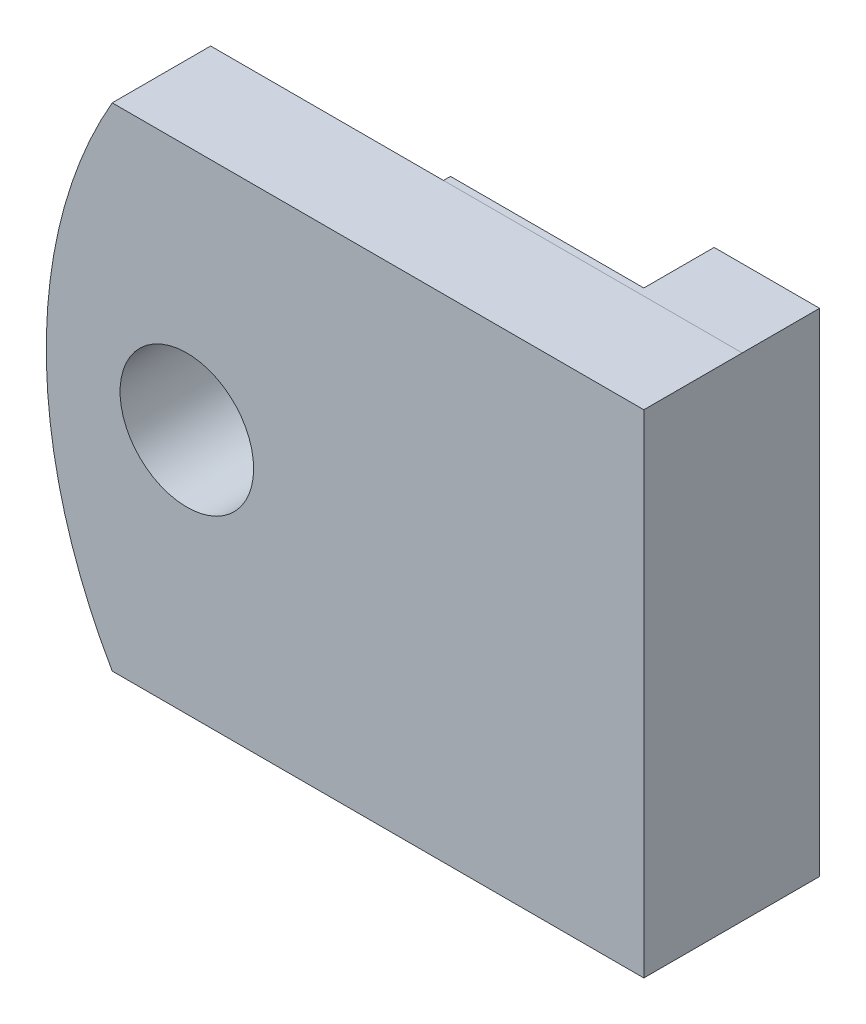
ISO-10303-21;
HEADER;
FILE_DESCRIPTION(('STEP AP214'),'2;1');
FILE_NAME('part.step','',(''),(''),'','','');
FILE_SCHEMA(('AUTOMOTIVE_DESIGN { 1 0 10303 214 1 1 1 1 }'));
ENDSEC;
DATA;
#1=APPLICATION_CONTEXT('core data for automotive mechanical design processes');
#2=APPLICATION_PROTOCOL_DEFINITION('international standard','automotive_design',2000,#1);
#3=PRODUCT_CONTEXT('',#1,'mechanical');
#4=PRODUCT('Part','Part','',(#3));
#5=PRODUCT_RELATED_PRODUCT_CATEGORY('part','',(#4));
#6=PRODUCT_DEFINITION_FORMATION('','',#4);
#7=PRODUCT_DEFINITION_CONTEXT('part definition',#1,'design');
#8=PRODUCT_DEFINITION('design','',#6,#7);
#9=PRODUCT_DEFINITION_SHAPE('','',#8);
#10=(LENGTH_UNIT() NAMED_UNIT(*) SI_UNIT(.MILLI.,.METRE.));
#11=(NAMED_UNIT(*) PLANE_ANGLE_UNIT() SI_UNIT($,.RADIAN.));
#12=(NAMED_UNIT(*) SI_UNIT($,.STERADIAN.) SOLID_ANGLE_UNIT());
#13=UNCERTAINTY_MEASURE_WITH_UNIT(LENGTH_MEASURE(1.E-05),#10,'distance_accuracy_value','');
#14=(GEOMETRIC_REPRESENTATION_CONTEXT(3) GLOBAL_UNCERTAINTY_ASSIGNED_CONTEXT((#13)) GLOBAL_UNIT_ASSIGNED_CONTEXT((#10,
#11,#12)) REPRESENTATION_CONTEXT('',''));
#15=CARTESIAN_POINT('',(0.,0.,0.));
#16=DIRECTION('',(0.,0.,1.));
#17=DIRECTION('',(1.,0.,0.));
#18=AXIS2_PLACEMENT_3D('',#15,#16,#17);
#19=CARTESIAN_POINT('',(0.,0.,-3.));
#20=DIRECTION('',(0.,0.,1.));
#21=DIRECTION('',(1.,0.,0.));
#22=AXIS2_PLACEMENT_3D('',#19,#20,#21);
#23=PLANE('',#22);
#24=DIRECTION('',(0.,1.,0.));
#25=VECTOR('',#24,1.);
#26=CARTESIAN_POINT('',(0.,-7.,-3.));
#27=LINE('',#26,#25);
#28=CARTESIAN_POINT('',(0.,-7.,-3.));
#29=VERTEX_POINT('',#28);
#30=CARTESIAN_POINT('',(0.,7.,-3.));
#31=VERTEX_POINT('',#30);
#32=EDGE_CURVE('E62',#29,#31,#27,.T.);
#33=ORIENTED_EDGE('',*,*,#32,.F.);
#34=DIRECTION('',(-1.,0.,0.));
#35=VECTOR('',#34,1.);
#36=CARTESIAN_POINT('',(3.,-7.,-3.));
#37=LINE('',#36,#35);
#38=CARTESIAN_POINT('',(-5.5,-7.,-3.));
#39=VERTEX_POINT('',#38);
#40=EDGE_CURVE('E159',#29,#39,#37,.T.);
#41=ORIENTED_EDGE('',*,*,#40,.T.);
#42=DIRECTION('',(0.,1.,0.));
#43=VECTOR('',#42,1.);
#44=CARTESIAN_POINT('',(-5.5,-7.,-3.));
#45=LINE('',#44,#43);
#46=CARTESIAN_POINT('',(-5.5,7.,-3.));
#47=VERTEX_POINT('',#46);
#48=EDGE_CURVE('E153',#39,#47,#45,.T.);
#49=ORIENTED_EDGE('',*,*,#48,.T.);
#50=DIRECTION('',(1.,0.,0.));
#51=VECTOR('',#50,1.);
#52=CARTESIAN_POINT('',(3.,7.,-3.));
#53=LINE('',#52,#51);
#54=EDGE_CURVE('E156',#47,#31,#53,.T.);
#55=ORIENTED_EDGE('',*,*,#54,.T.);
#56=EDGE_LOOP('',(#33,#41,#49,#55));
#57=FACE_BOUND('',#56,.T.);
#58=ADVANCED_FACE('F45',(#57),#23,.F.);
#59=CARTESIAN_POINT('',(-0.0012570221326752,-9.61092998937416E-06,-2.8));
#60=DIRECTION('',(0.,0.,1.));
#61=DIRECTION('',(1.,0.,0.));
#62=AXIS2_PLACEMENT_3D('',#59,#60,#61);
#63=PLANE('',#62);
#64=CARTESIAN_POINT('',(-10.000000707318,1.17651066731776E-07,-2.8));
#65=DIRECTION('',(0.,0.,1.));
#66=DIRECTION('',(1.,0.,0.));
#67=AXIS2_PLACEMENT_3D('',#64,#65,#66);
#68=CIRCLE('',#67,1.8999135201264);
#69=CARTESIAN_POINT('',(-8.10008718719156,1.17651066731776E-07,-2.8));
#70=VERTEX_POINT('',#69);
#71=EDGE_CURVE('E170',#70,#70,#68,.T.);
#72=ORIENTED_EDGE('',*,*,#71,.T.);
#73=EDGE_LOOP('',(#72));
#74=FACE_BOUND('',#73,.T.);
#75=DIRECTION('',(-1.,0.,0.));
#76=VECTOR('',#75,1.);
#77=CARTESIAN_POINT('',(3.,-7.,-2.8));
#78=LINE('',#77,#76);
#79=CARTESIAN_POINT('',(3.,-7.,-2.8));
#80=VERTEX_POINT('',#79);
#81=CARTESIAN_POINT('',(-5.5,-7.,-2.8));
#82=VERTEX_POINT('',#81);
#83=EDGE_CURVE('E157',#80,#82,#78,.T.);
#84=ORIENTED_EDGE('',*,*,#83,.F.);
#85=DIRECTION('',(0.999999999943476,1.06323768107849E-05,0.));
#86=VECTOR('',#85,1.);
#87=CARTESIAN_POINT('',(-12.1233784525985,-7.00016079745837,-2.8));
#88=LINE('',#87,#86);
#89=CARTESIAN_POINT('',(-12.1233784525985,-7.00016079745837,-2.8));
#90=VERTEX_POINT('',#89);
#91=EDGE_CURVE('E183',#90,#80,#88,.T.);
#92=ORIENTED_EDGE('',*,*,#91,.F.);
#93=CARTESIAN_POINT('',(-0.0012570221326752,-9.61092998937416E-06,-2.8));
#94=DIRECTION('',(0.,0.,1.));
#95=DIRECTION('',(1.,0.,0.));
#96=AXIS2_PLACEMENT_3D('',#93,#94,#95);
#97=CIRCLE('',#96,13.9981407554437);
#98=CARTESIAN_POINT('',(-12.1233701280963,7.00015599107111,-2.8));
#99=VERTEX_POINT('',#98);
#100=EDGE_CURVE('E179',#99,#90,#97,.T.);
#101=ORIENTED_EDGE('',*,*,#100,.F.);
#102=DIRECTION('',(-0.999999999946805,1.03145707457565E-05,0.));
#103=VECTOR('',#102,1.);
#104=CARTESIAN_POINT('',(3.,7.,-2.8));
#105=LINE('',#104,#103);
#106=CARTESIAN_POINT('',(3.,7.,-2.8));
#107=VERTEX_POINT('',#106);
#108=EDGE_CURVE('E176',#107,#99,#105,.T.);
#109=ORIENTED_EDGE('',*,*,#108,.F.);
#110=DIRECTION('',(1.,0.,0.));
#111=VECTOR('',#110,1.);
#112=CARTESIAN_POINT('',(3.,7.,-2.8));
#113=LINE('',#112,#111);
#114=CARTESIAN_POINT('',(-5.5,7.,-2.8));
#115=VERTEX_POINT('',#114);
#116=EDGE_CURVE('E125',#115,#107,#113,.T.);
#117=ORIENTED_EDGE('',*,*,#116,.F.);
#118=DIRECTION('',(0.,1.,0.));
#119=VECTOR('',#118,1.);
#120=CARTESIAN_POINT('',(-5.5,-7.,-2.8));
#121=LINE('',#120,#119);
#122=EDGE_CURVE('E70',#82,#115,#121,.T.);
#123=ORIENTED_EDGE('',*,*,#122,.F.);
#124=EDGE_LOOP('',(#84,#92,#101,#109,#117,#123));
#125=FACE_BOUND('',#124,.T.);
#126=ADVANCED_FACE('F230',(#74,#125),#63,.F.);
#127=CARTESIAN_POINT('',(3.,-7.,-2.8));
#128=DIRECTION('',(1.,0.,0.));
#129=DIRECTION('',(0.,0.,-1.));
#130=AXIS2_PLACEMENT_3D('',#127,#128,#129);
#131=PLANE('',#130);
#132=DIRECTION('',(0.,1.,0.));
#133=VECTOR('',#132,1.);
#134=CARTESIAN_POINT('',(3.,-7.,0.));
#135=LINE('',#134,#133);
#136=CARTESIAN_POINT('',(3.,-7.,0.));
#137=VERTEX_POINT('',#136);
#138=CARTESIAN_POINT('',(3.,7.,0.));
#139=VERTEX_POINT('',#138);
#140=EDGE_CURVE('E173',#137,#139,#135,.T.);
#141=ORIENTED_EDGE('',*,*,#140,.F.);
#142=DIRECTION('',(0.,0.,1.));
#143=VECTOR('',#142,1.);
#144=CARTESIAN_POINT('',(3.,-7.,-2.8));
#145=LINE('',#144,#143);
#146=EDGE_CURVE('E11',#80,#137,#145,.T.);
#147=ORIENTED_EDGE('',*,*,#146,.F.);
#148=DIRECTION('',(0.,0.,1.));
#149=VECTOR('',#148,1.);
#150=CARTESIAN_POINT('',(3.,-7.,-3.));
#151=LINE('',#150,#149);
#152=CARTESIAN_POINT('',(3.,-7.,-5.));
#153=VERTEX_POINT('',#152);
#154=EDGE_CURVE('E128',#153,#80,#151,.T.);
#155=ORIENTED_EDGE('',*,*,#154,.F.);
#156=DIRECTION('',(0.,-1.,0.));
#157=VECTOR('',#156,1.);
#158=CARTESIAN_POINT('',(3.,7.,-5.));
#159=LINE('',#158,#157);
#160=CARTESIAN_POINT('',(3.,7.,-5.));
#161=VERTEX_POINT('',#160);
#162=EDGE_CURVE('E131',#161,#153,#159,.T.);
#163=ORIENTED_EDGE('',*,*,#162,.F.);
#164=DIRECTION('',(0.,0.,1.));
#165=VECTOR('',#164,1.);
#166=CARTESIAN_POINT('',(3.,7.,-3.));
#167=LINE('',#166,#165);
#168=EDGE_CURVE('E118',#161,#107,#167,.T.);
#169=ORIENTED_EDGE('',*,*,#168,.T.);
#170=DIRECTION('',(0.,0.,1.));
#171=VECTOR('',#170,1.);
#172=CARTESIAN_POINT('',(3.,7.,-2.8));
#173=LINE('',#172,#171);
#174=EDGE_CURVE('E49',#107,#139,#173,.T.);
#175=ORIENTED_EDGE('',*,*,#174,.T.);
#176=EDGE_LOOP('',(#141,#147,#155,#163,#169,#175));
#177=FACE_BOUND('',#176,.T.);
#178=ADVANCED_FACE('F47',(#177),#131,.T.);
#179=CARTESIAN_POINT('',(-12.1233784525985,-7.00016079745837,-2.8));
#180=DIRECTION('',(1.06323768107849E-05,-0.999999999943476,0.));
#181=DIRECTION('',(0.999999999943476,1.06323768107849E-05,0.));
#182=AXIS2_PLACEMENT_3D('',#179,#180,#181);
#183=PLANE('',#182);
#184=DIRECTION('',(0.999999999943476,1.06323768107849E-05,0.));
#185=VECTOR('',#184,1.);
#186=CARTESIAN_POINT('',(-12.1233784525985,-7.00016079745837,0.));
#187=LINE('',#186,#185);
#188=CARTESIAN_POINT('',(-12.1233784525985,-7.00016079745837,0.));
#189=VERTEX_POINT('',#188);
#190=EDGE_CURVE('E180',#189,#137,#187,.T.);
#191=ORIENTED_EDGE('',*,*,#190,.F.);
#192=DIRECTION('',(0.,0.,1.));
#193=VECTOR('',#192,1.);
#194=CARTESIAN_POINT('',(-12.1233784525985,-7.00016079745837,-2.8));
#195=LINE('',#194,#193);
#196=EDGE_CURVE('E54',#90,#189,#195,.T.);
#197=ORIENTED_EDGE('',*,*,#196,.F.);
#198=ORIENTED_EDGE('',*,*,#91,.T.);
#199=ORIENTED_EDGE('',*,*,#146,.T.);
#200=EDGE_LOOP('',(#191,#197,#198,#199));
#201=FACE_BOUND('',#200,.T.);
#202=ADVANCED_FACE('F206',(#201),#183,.T.);
#203=CARTESIAN_POINT('',(-0.0012570221326752,-9.61092998937416E-06,-2.8));
#204=DIRECTION('',(0.,0.,1.));
#205=DIRECTION('',(1.,0.,0.));
#206=AXIS2_PLACEMENT_3D('',#203,#204,#205);
#207=CYLINDRICAL_SURFACE('',#206,13.9981407554437);
#208=CARTESIAN_POINT('',(-0.0012570221326752,-9.61092998937416E-06,0.));
#209=DIRECTION('',(0.,0.,1.));
#210=DIRECTION('',(1.,0.,0.));
#211=AXIS2_PLACEMENT_3D('',#208,#209,#210);
#212=CIRCLE('',#211,13.9981407554437);
#213=CARTESIAN_POINT('',(-12.1233701280963,7.00015599107111,0.));
#214=VERTEX_POINT('',#213);
#215=EDGE_CURVE('E191',#214,#189,#212,.T.);
#216=ORIENTED_EDGE('',*,*,#215,.F.);
#217=DIRECTION('',(0.,0.,1.));
#218=VECTOR('',#217,1.);
#219=CARTESIAN_POINT('',(-12.1233701280963,7.00015599107111,-2.8));
#220=LINE('',#219,#218);
#221=EDGE_CURVE('E196',#99,#214,#220,.T.);
#222=ORIENTED_EDGE('',*,*,#221,.F.);
#223=ORIENTED_EDGE('',*,*,#100,.T.);
#224=ORIENTED_EDGE('',*,*,#196,.T.);
#225=EDGE_LOOP('',(#216,#222,#223,#224));
#226=FACE_BOUND('',#225,.T.);
#227=ADVANCED_FACE('F295',(#226),#207,.T.);
#228=CARTESIAN_POINT('',(3.,7.,-2.8));
#229=DIRECTION('',(1.03145707457565E-05,0.999999999946805,0.));
#230=DIRECTION('',(-0.999999999946805,1.03145707457565E-05,0.));
#231=AXIS2_PLACEMENT_3D('',#228,#229,#230);
#232=PLANE('',#231);
#233=DIRECTION('',(-0.999999999946805,1.03145707457565E-05,0.));
#234=VECTOR('',#233,1.);
#235=CARTESIAN_POINT('',(3.,7.,0.));
#236=LINE('',#235,#234);
#237=EDGE_CURVE('E188',#139,#214,#236,.T.);
#238=ORIENTED_EDGE('',*,*,#237,.F.);
#239=ORIENTED_EDGE('',*,*,#174,.F.);
#240=ORIENTED_EDGE('',*,*,#108,.T.);
#241=ORIENTED_EDGE('',*,*,#221,.T.);
#242=EDGE_LOOP('',(#238,#239,#240,#241));
#243=FACE_BOUND('',#242,.T.);
#244=ADVANCED_FACE('F201',(#243),#232,.T.);
#245=CARTESIAN_POINT('',(-0.0012570221326752,-9.61092998937416E-06,0.));
#246=DIRECTION('',(0.,0.,1.));
#247=DIRECTION('',(1.,0.,0.));
#248=AXIS2_PLACEMENT_3D('',#245,#246,#247);
#249=PLANE('',#248);
#250=CARTESIAN_POINT('',(-10.000000707318,1.17651066731776E-07,0.));
#251=DIRECTION('',(0.,0.,1.));
#252=DIRECTION('',(1.,0.,0.));
#253=AXIS2_PLACEMENT_3D('',#250,#251,#252);
#254=CIRCLE('',#253,1.8999135201264);
#255=CARTESIAN_POINT('',(-8.10008718719156,1.17651066731776E-07,0.));
#256=VERTEX_POINT('',#255);
#257=EDGE_CURVE('E169',#256,#256,#254,.T.);
#258=ORIENTED_EDGE('',*,*,#257,.F.);
#259=EDGE_LOOP('',(#258));
#260=FACE_BOUND('',#259,.T.);
#261=ORIENTED_EDGE('',*,*,#140,.T.);
#262=ORIENTED_EDGE('',*,*,#237,.T.);
#263=ORIENTED_EDGE('',*,*,#215,.T.);
#264=ORIENTED_EDGE('',*,*,#190,.T.);
#265=EDGE_LOOP('',(#261,#262,#263,#264));
#266=FACE_BOUND('',#265,.T.);
#267=ADVANCED_FACE('F203',(#260,#266),#249,.T.);
#268=CARTESIAN_POINT('',(-10.000000707318,1.17651066731776E-07,-2.8));
#269=DIRECTION('',(0.,0.,1.));
#270=DIRECTION('',(1.,0.,0.));
#271=AXIS2_PLACEMENT_3D('',#268,#269,#270);
#272=CYLINDRICAL_SURFACE('',#271,1.8999135201264);
#273=ORIENTED_EDGE('',*,*,#71,.F.);
#274=EDGE_LOOP('',(#273));
#275=FACE_BOUND('',#274,.T.);
#276=ORIENTED_EDGE('',*,*,#257,.T.);
#277=EDGE_LOOP('',(#276));
#278=FACE_BOUND('',#277,.T.);
#279=ADVANCED_FACE('F220',(#275,#278),#272,.F.);
#280=CARTESIAN_POINT('',(-5.5,-7.,-3.));
#281=DIRECTION('',(1.,0.,0.));
#282=DIRECTION('',(0.,0.,-1.));
#283=AXIS2_PLACEMENT_3D('',#280,#281,#282);
#284=PLANE('',#283);
#285=ORIENTED_EDGE('',*,*,#122,.T.);
#286=DIRECTION('',(0.,0.,1.));
#287=VECTOR('',#286,1.);
#288=CARTESIAN_POINT('',(-5.5,7.,-3.));
#289=LINE('',#288,#287);
#290=EDGE_CURVE('E127',#47,#115,#289,.T.);
#291=ORIENTED_EDGE('',*,*,#290,.F.);
#292=ORIENTED_EDGE('',*,*,#48,.F.);
#293=DIRECTION('',(0.,0.,1.));
#294=VECTOR('',#293,1.);
#295=CARTESIAN_POINT('',(-5.5,-7.,-3.));
#296=LINE('',#295,#294);
#297=EDGE_CURVE('E161',#39,#82,#296,.T.);
#298=ORIENTED_EDGE('',*,*,#297,.T.);
#299=EDGE_LOOP('',(#285,#291,#292,#298));
#300=FACE_BOUND('',#299,.T.);
#301=ADVANCED_FACE('F218',(#300),#284,.F.);
#302=CARTESIAN_POINT('',(3.,7.,-3.));
#303=DIRECTION('',(0.,-1.,0.));
#304=DIRECTION('',(0.,0.,-1.));
#305=AXIS2_PLACEMENT_3D('',#302,#303,#304);
#306=PLANE('',#305);
#307=ORIENTED_EDGE('',*,*,#116,.T.);
#308=ORIENTED_EDGE('',*,*,#168,.F.);
#309=DIRECTION('',(1.,0.,0.));
#310=VECTOR('',#309,1.);
#311=CARTESIAN_POINT('',(0.,7.,-5.));
#312=LINE('',#311,#310);
#313=CARTESIAN_POINT('',(0.,7.,-5.));
#314=VERTEX_POINT('',#313);
#315=EDGE_CURVE('E123',#314,#161,#312,.T.);
#316=ORIENTED_EDGE('',*,*,#315,.F.);
#317=DIRECTION('',(0.,0.,1.));
#318=VECTOR('',#317,1.);
#319=CARTESIAN_POINT('',(0.,7.,-5.));
#320=LINE('',#319,#318);
#321=EDGE_CURVE('E147',#314,#31,#320,.T.);
#322=ORIENTED_EDGE('',*,*,#321,.T.);
#323=ORIENTED_EDGE('',*,*,#54,.F.);
#324=ORIENTED_EDGE('',*,*,#290,.T.);
#325=EDGE_LOOP('',(#307,#308,#316,#322,#323,#324));
#326=FACE_BOUND('',#325,.T.);
#327=ADVANCED_FACE('F120',(#326),#306,.F.);
#328=CARTESIAN_POINT('',(3.,-7.,-3.));
#329=DIRECTION('',(0.,1.,0.));
#330=DIRECTION('',(0.,0.,1.));
#331=AXIS2_PLACEMENT_3D('',#328,#329,#330);
#332=PLANE('',#331);
#333=ORIENTED_EDGE('',*,*,#83,.T.);
#334=ORIENTED_EDGE('',*,*,#297,.F.);
#335=ORIENTED_EDGE('',*,*,#40,.F.);
#336=DIRECTION('',(0.,0.,1.));
#337=VECTOR('',#336,1.);
#338=CARTESIAN_POINT('',(0.,-7.,-5.));
#339=LINE('',#338,#337);
#340=CARTESIAN_POINT('',(0.,-7.,-5.));
#341=VERTEX_POINT('',#340);
#342=EDGE_CURVE('E150',#341,#29,#339,.T.);
#343=ORIENTED_EDGE('',*,*,#342,.F.);
#344=DIRECTION('',(-1.,0.,0.));
#345=VECTOR('',#344,1.);
#346=CARTESIAN_POINT('',(3.,-7.,-5.));
#347=LINE('',#346,#345);
#348=EDGE_CURVE('E137',#153,#341,#347,.T.);
#349=ORIENTED_EDGE('',*,*,#348,.F.);
#350=ORIENTED_EDGE('',*,*,#154,.T.);
#351=EDGE_LOOP('',(#333,#334,#335,#343,#349,#350));
#352=FACE_BOUND('',#351,.T.);
#353=ADVANCED_FACE('F210',(#352),#332,.F.);
#354=CARTESIAN_POINT('',(0.,-7.,-5.));
#355=DIRECTION('',(1.,0.,0.));
#356=DIRECTION('',(0.,0.,-1.));
#357=AXIS2_PLACEMENT_3D('',#354,#355,#356);
#358=PLANE('',#357);
#359=ORIENTED_EDGE('',*,*,#32,.T.);
#360=ORIENTED_EDGE('',*,*,#321,.F.);
#361=DIRECTION('',(0.,1.,0.));
#362=VECTOR('',#361,1.);
#363=CARTESIAN_POINT('',(0.,-7.,-5.));
#364=LINE('',#363,#362);
#365=EDGE_CURVE('E141',#341,#314,#364,.T.);
#366=ORIENTED_EDGE('',*,*,#365,.F.);
#367=ORIENTED_EDGE('',*,*,#342,.T.);
#368=EDGE_LOOP('',(#359,#360,#366,#367));
#369=FACE_BOUND('',#368,.T.);
#370=ADVANCED_FACE('F214',(#369),#358,.F.);
#371=CARTESIAN_POINT('',(0.,0.,-5.));
#372=DIRECTION('',(0.,0.,-1.));
#373=DIRECTION('',(-1.,0.,0.));
#374=AXIS2_PLACEMENT_3D('',#371,#372,#373);
#375=PLANE('',#374);
#376=ORIENTED_EDGE('',*,*,#315,.T.);
#377=ORIENTED_EDGE('',*,*,#162,.T.);
#378=ORIENTED_EDGE('',*,*,#348,.T.);
#379=ORIENTED_EDGE('',*,*,#365,.T.);
#380=EDGE_LOOP('',(#376,#377,#378,#379));
#381=FACE_BOUND('',#380,.T.);
#382=ADVANCED_FACE('F139',(#381),#375,.T.);
#383=CLOSED_SHELL('',(#58,#126,#178,#202,#227,#244,#267,#279,#301,#327,#353,#370,#382));
#384=MANIFOLD_SOLID_BREP('B2',#383);
#385=ADVANCED_BREP_SHAPE_REPRESENTATION('',(#18,#384),#14);
#386=SHAPE_DEFINITION_REPRESENTATION(#9,#385);
ENDSEC;
END-ISO-10303-21;
